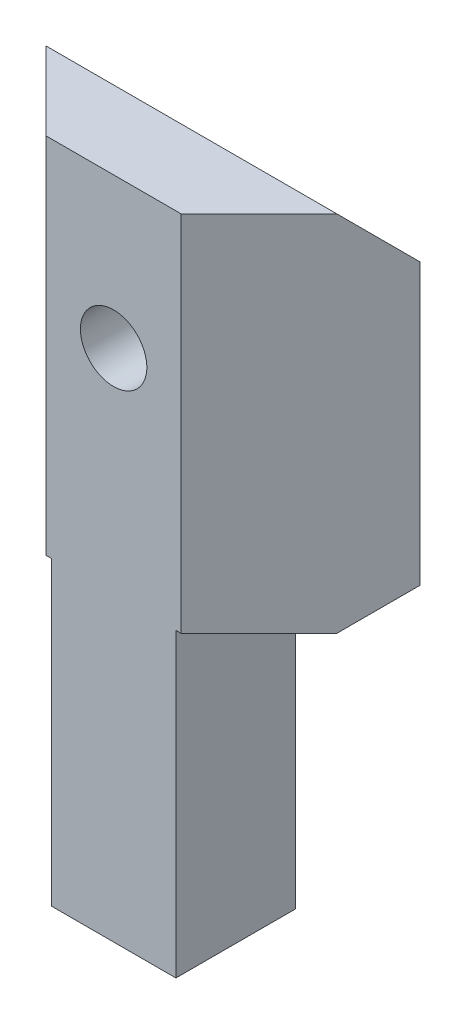
ISO-10303-21;
HEADER;
FILE_DESCRIPTION(('STEP AP214'),'2;1');
FILE_NAME('part.step','',(''),(''),'','','');
FILE_SCHEMA(('AUTOMOTIVE_DESIGN { 1 0 10303 214 1 1 1 1 }'));
ENDSEC;
DATA;
#1=APPLICATION_CONTEXT('core data for automotive mechanical design processes');
#2=APPLICATION_PROTOCOL_DEFINITION('international standard','automotive_design',2000,#1);
#3=PRODUCT_CONTEXT('',#1,'mechanical');
#4=PRODUCT('Part','Part','',(#3));
#5=PRODUCT_RELATED_PRODUCT_CATEGORY('part','',(#4));
#6=PRODUCT_DEFINITION_FORMATION('','',#4);
#7=PRODUCT_DEFINITION_CONTEXT('part definition',#1,'design');
#8=PRODUCT_DEFINITION('design','',#6,#7);
#9=PRODUCT_DEFINITION_SHAPE('','',#8);
#10=(LENGTH_UNIT() NAMED_UNIT(*) SI_UNIT(.MILLI.,.METRE.));
#11=(NAMED_UNIT(*) PLANE_ANGLE_UNIT() SI_UNIT($,.RADIAN.));
#12=(NAMED_UNIT(*) SI_UNIT($,.STERADIAN.) SOLID_ANGLE_UNIT());
#13=UNCERTAINTY_MEASURE_WITH_UNIT(LENGTH_MEASURE(1.E-05),#10,'distance_accuracy_value','');
#14=(GEOMETRIC_REPRESENTATION_CONTEXT(3) GLOBAL_UNCERTAINTY_ASSIGNED_CONTEXT((#13)) GLOBAL_UNIT_ASSIGNED_CONTEXT((#10,
#11,#12)) REPRESENTATION_CONTEXT('',''));
#15=CARTESIAN_POINT('',(0.,0.,0.));
#16=DIRECTION('',(0.,0.,1.));
#17=DIRECTION('',(1.,0.,0.));
#18=AXIS2_PLACEMENT_3D('',#15,#16,#17);
#19=CARTESIAN_POINT('',(-7.80064652290031,24.7693,-0.804871060171912));
#20=DIRECTION('',(0.,0.,-1.));
#21=DIRECTION('',(-1.,0.,0.));
#22=AXIS2_PLACEMENT_3D('',#19,#20,#21);
#23=CYLINDRICAL_SURFACE('',#22,1.6);
#24=CARTESIAN_POINT('',(-7.80064652290031,24.7693,-1.05487106017191));
#25=DIRECTION('',(0.,0.,-1.));
#26=DIRECTION('',(-1.,0.,0.));
#27=AXIS2_PLACEMENT_3D('',#24,#25,#26);
#28=CIRCLE('',#27,1.6);
#29=CARTESIAN_POINT('',(-9.40064652290032,24.7693,-1.05487106017191));
#30=VERTEX_POINT('',#29);
#31=EDGE_CURVE('E123',#30,#30,#28,.F.);
#32=ORIENTED_EDGE('',*,*,#31,.T.);
#33=EDGE_LOOP('',(#32));
#34=FACE_BOUND('',#33,.T.);
#35=CARTESIAN_POINT('',(-7.80064652290031,24.7693,-4.30487106017191));
#36=DIRECTION('',(0.,0.,-1.));
#37=DIRECTION('',(-1.,0.,0.));
#38=AXIS2_PLACEMENT_3D('',#35,#36,#37);
#39=CIRCLE('',#38,1.6);
#40=CARTESIAN_POINT('',(-9.40064652290032,24.7693,-4.30487106017191));
#41=VERTEX_POINT('',#40);
#42=EDGE_CURVE('E181',#41,#41,#39,.F.);
#43=ORIENTED_EDGE('',*,*,#42,.F.);
#44=EDGE_LOOP('',(#43));
#45=FACE_BOUND('',#44,.T.);
#46=ADVANCED_FACE('F31',(#34,#45),#23,.F.);
#47=CARTESIAN_POINT('',(1.19935347709971,32.,-6.80487106017191));
#48=DIRECTION('',(-0.707106781186544,0.,-0.707106781186551));
#49=DIRECTION('',(-0.707106781186551,0.,0.707106781186544));
#50=AXIS2_PLACEMENT_3D('',#47,#48,#49);
#51=PLANE('',#50);
#52=DIRECTION('',(0.707106781186551,0.,-0.707106781186544));
#53=VECTOR('',#52,1.);
#54=CARTESIAN_POINT('',(1.19935347709971,32.,-6.80487106017191));
#55=LINE('',#54,#53);
#56=CARTESIAN_POINT('',(-4.55064652290035,32.,-1.05487106017191));
#57=VERTEX_POINT('',#56);
#58=CARTESIAN_POINT('',(-0.800646522900304,32.,-4.80487106017192));
#59=VERTEX_POINT('',#58);
#60=EDGE_CURVE('E130',#57,#59,#55,.T.);
#61=ORIENTED_EDGE('',*,*,#60,.F.);
#62=DIRECTION('',(0.,-1.,0.));
#63=VECTOR('',#62,1.);
#64=CARTESIAN_POINT('',(-4.55064652290035,32.,-1.05487106017191));
#65=LINE('',#64,#63);
#66=CARTESIAN_POINT('',(-4.55064652290035,14.5,-1.05487106017191));
#67=VERTEX_POINT('',#66);
#68=EDGE_CURVE('E113',#57,#67,#65,.T.);
#69=ORIENTED_EDGE('',*,*,#68,.T.);
#70=DIRECTION('',(-0.707106781186551,0.,0.707106781186544));
#71=VECTOR('',#70,1.);
#72=CARTESIAN_POINT('',(1.19935347709971,14.5,-6.80487106017191));
#73=LINE('',#72,#71);
#74=CARTESIAN_POINT('',(-0.800646522900307,14.5,-4.80487106017192));
#75=VERTEX_POINT('',#74);
#76=EDGE_CURVE('E212',#75,#67,#73,.T.);
#77=ORIENTED_EDGE('',*,*,#76,.F.);
#78=DIRECTION('',(0.577350269189629,0.577350269189625,-0.577350269189623));
#79=VECTOR('',#78,1.);
#80=CARTESIAN_POINT('',(-2.13397985623367,13.1666666666666,-3.47153772683856));
#81=LINE('',#80,#79);
#82=CARTESIAN_POINT('',(1.19935347709971,16.5,-6.80487106017191));
#83=VERTEX_POINT('',#82);
#84=EDGE_CURVE('E176',#75,#83,#81,.T.);
#85=ORIENTED_EDGE('',*,*,#84,.T.);
#86=DIRECTION('',(0.,-1.,0.));
#87=VECTOR('',#86,1.);
#88=CARTESIAN_POINT('',(1.19935347709971,32.,-6.80487106017191));
#89=LINE('',#88,#87);
#90=CARTESIAN_POINT('',(1.19935347709971,30.,-6.80487106017191));
#91=VERTEX_POINT('',#90);
#92=EDGE_CURVE('E145',#91,#83,#89,.T.);
#93=ORIENTED_EDGE('',*,*,#92,.F.);
#94=DIRECTION('',(-0.577350269189629,0.577350269189625,0.577350269189623));
#95=VECTOR('',#94,1.);
#96=CARTESIAN_POINT('',(-3.13397985623369,34.3333333333334,-2.47153772683856));
#97=LINE('',#96,#95);
#98=EDGE_CURVE('E140',#91,#59,#97,.T.);
#99=ORIENTED_EDGE('',*,*,#98,.T.);
#100=EDGE_LOOP('',(#61,#69,#77,#85,#93,#99));
#101=FACE_BOUND('',#100,.T.);
#102=ADVANCED_FACE('F137',(#101),#51,.F.);
#103=CARTESIAN_POINT('',(-10.8006465229004,32.,-0.804871060171912));
#104=DIRECTION('',(0.707106781186549,0.,-0.707106781186547));
#105=DIRECTION('',(-0.707106781186546,0.,-0.707106781186549));
#106=AXIS2_PLACEMENT_3D('',#103,#104,#105);
#107=PLANE('',#106);
#108=DIRECTION('',(-0.707106781186547,0.,-0.707106781186549));
#109=VECTOR('',#108,1.);
#110=CARTESIAN_POINT('',(-16.8006465229003,14.5,-6.80487106017191));
#111=LINE('',#110,#109);
#112=CARTESIAN_POINT('',(-11.0506465229004,14.5,-1.05487106017191));
#113=VERTEX_POINT('',#112);
#114=CARTESIAN_POINT('',(-14.8006465229003,14.5,-4.80487106017191));
#115=VERTEX_POINT('',#114);
#116=EDGE_CURVE('E202',#113,#115,#111,.T.);
#117=ORIENTED_EDGE('',*,*,#116,.F.);
#118=DIRECTION('',(0.,1.,0.));
#119=VECTOR('',#118,1.);
#120=CARTESIAN_POINT('',(-11.0506465229004,32.,-1.05487106017191));
#121=LINE('',#120,#119);
#122=CARTESIAN_POINT('',(-11.0506465229004,32.,-1.05487106017191));
#123=VERTEX_POINT('',#122);
#124=EDGE_CURVE('E46',#113,#123,#121,.T.);
#125=ORIENTED_EDGE('',*,*,#124,.T.);
#126=DIRECTION('',(0.707106781186547,0.,0.707106781186549));
#127=VECTOR('',#126,1.);
#128=CARTESIAN_POINT('',(-10.8006465229004,32.,-0.804871060171912));
#129=LINE('',#128,#127);
#130=CARTESIAN_POINT('',(-14.8006465229003,32.,-4.80487106017191));
#131=VERTEX_POINT('',#130);
#132=EDGE_CURVE('E133',#131,#123,#129,.T.);
#133=ORIENTED_EDGE('',*,*,#132,.F.);
#134=DIRECTION('',(-0.577350269189624,-0.577350269189628,-0.577350269189626));
#135=VECTOR('',#134,1.);
#136=CARTESIAN_POINT('',(-12.467313189567,34.3333333333333,-2.4715377268386));
#137=LINE('',#136,#135);
#138=CARTESIAN_POINT('',(-16.8006465229003,30.,-6.80487106017191));
#139=VERTEX_POINT('',#138);
#140=EDGE_CURVE('E158',#131,#139,#137,.T.);
#141=ORIENTED_EDGE('',*,*,#140,.T.);
#142=DIRECTION('',(0.,-1.,0.));
#143=VECTOR('',#142,1.);
#144=CARTESIAN_POINT('',(-16.8006465229003,32.,-6.80487106017191));
#145=LINE('',#144,#143);
#146=CARTESIAN_POINT('',(-16.8006465229003,16.5,-6.80487106017191));
#147=VERTEX_POINT('',#146);
#148=EDGE_CURVE('E142',#139,#147,#145,.T.);
#149=ORIENTED_EDGE('',*,*,#148,.T.);
#150=DIRECTION('',(-0.577350269189624,0.577350269189628,-0.577350269189626));
#151=VECTOR('',#150,1.);
#152=CARTESIAN_POINT('',(-13.467313189567,13.1666666666667,-3.47153772683859));
#153=LINE('',#152,#151);
#154=EDGE_CURVE('E171',#147,#115,#153,.F.);
#155=ORIENTED_EDGE('',*,*,#154,.T.);
#156=EDGE_LOOP('',(#117,#125,#133,#141,#149,#155));
#157=FACE_BOUND('',#156,.T.);
#158=ADVANCED_FACE('F238',(#157),#107,.F.);
#159=CARTESIAN_POINT('',(-16.8006465229003,32.,-6.80487106017191));
#160=DIRECTION('',(0.,0.,1.));
#161=DIRECTION('',(1.,0.,0.));
#162=AXIS2_PLACEMENT_3D('',#159,#160,#161);
#163=PLANE('',#162);
#164=CARTESIAN_POINT('',(-7.80064652290031,24.7693,-6.80487106017191));
#165=DIRECTION('',(0.,0.,-1.));
#166=DIRECTION('',(-1.,0.,0.));
#167=AXIS2_PLACEMENT_3D('',#164,#165,#166);
#168=CIRCLE('',#167,2.875);
#169=CARTESIAN_POINT('',(-10.6756465229003,24.7693,-6.80487106017191));
#170=VERTEX_POINT('',#169);
#171=EDGE_CURVE('E191',#170,#170,#168,.T.);
#172=ORIENTED_EDGE('',*,*,#171,.F.);
#173=EDGE_LOOP('',(#172));
#174=FACE_BOUND('',#173,.T.);
#175=DIRECTION('',(0.,-1.,0.));
#176=VECTOR('',#175,1.);
#177=CARTESIAN_POINT('',(-10.8006465229004,14.5,-6.80487106017191));
#178=LINE('',#177,#176);
#179=CARTESIAN_POINT('',(-10.8006465229004,16.5,-6.80487106017191));
#180=VERTEX_POINT('',#179);
#181=CARTESIAN_POINT('',(-10.8006465229004,0.,-6.80487106017191));
#182=VERTEX_POINT('',#181);
#183=EDGE_CURVE('E207',#180,#182,#178,.T.);
#184=ORIENTED_EDGE('',*,*,#183,.F.);
#185=DIRECTION('',(-1.,0.,0.));
#186=VECTOR('',#185,1.);
#187=CARTESIAN_POINT('',(-16.8006465229003,16.5,-6.80487106017191));
#188=LINE('',#187,#186);
#189=EDGE_CURVE('E169',#180,#147,#188,.T.);
#190=ORIENTED_EDGE('',*,*,#189,.T.);
#191=ORIENTED_EDGE('',*,*,#148,.F.);
#192=DIRECTION('',(1.,0.,0.));
#193=VECTOR('',#192,1.);
#194=CARTESIAN_POINT('',(1.19935347709971,30.,-6.80487106017191));
#195=LINE('',#194,#193);
#196=EDGE_CURVE('E160',#139,#91,#195,.T.);
#197=ORIENTED_EDGE('',*,*,#196,.T.);
#198=ORIENTED_EDGE('',*,*,#92,.T.);
#199=DIRECTION('',(-1.,0.,0.));
#200=VECTOR('',#199,1.);
#201=CARTESIAN_POINT('',(-4.80064652290035,16.5,-6.80487106017191));
#202=LINE('',#201,#200);
#203=CARTESIAN_POINT('',(-4.80064652290035,16.5,-6.80487106017191));
#204=VERTEX_POINT('',#203);
#205=EDGE_CURVE('E166',#83,#204,#202,.T.);
#206=ORIENTED_EDGE('',*,*,#205,.T.);
#207=DIRECTION('',(0.,-1.,0.));
#208=VECTOR('',#207,1.);
#209=CARTESIAN_POINT('',(-4.80064652290035,14.5,-6.80487106017191));
#210=LINE('',#209,#208);
#211=CARTESIAN_POINT('',(-4.80064652290035,0.,-6.80487106017191));
#212=VERTEX_POINT('',#211);
#213=EDGE_CURVE('E152',#204,#212,#210,.T.);
#214=ORIENTED_EDGE('',*,*,#213,.T.);
#215=DIRECTION('',(-1.,0.,0.));
#216=VECTOR('',#215,1.);
#217=CARTESIAN_POINT('',(-16.8006465229003,0.,-6.80487106017191));
#218=LINE('',#217,#216);
#219=EDGE_CURVE('E147',#212,#182,#218,.T.);
#220=ORIENTED_EDGE('',*,*,#219,.T.);
#221=EDGE_LOOP('',(#184,#190,#191,#197,#198,#206,#214,#220));
#222=FACE_BOUND('',#221,.T.);
#223=ADVANCED_FACE('F218',(#174,#222),#163,.F.);
#224=CARTESIAN_POINT('',(-7.80064652290037,32.,2.19512893982807));
#225=DIRECTION('',(0.,1.,0.));
#226=DIRECTION('',(0.,0.,1.));
#227=AXIS2_PLACEMENT_3D('',#224,#225,#226);
#228=PLANE('',#227);
#229=DIRECTION('',(-1.,0.,0.));
#230=VECTOR('',#229,1.);
#231=CARTESIAN_POINT('',(-12.3310591106609,32.,-1.05487106017191));
#232=LINE('',#231,#230);
#233=EDGE_CURVE('E117',#57,#123,#232,.T.);
#234=ORIENTED_EDGE('',*,*,#233,.F.);
#235=ORIENTED_EDGE('',*,*,#60,.T.);
#236=DIRECTION('',(-1.,0.,0.));
#237=VECTOR('',#236,1.);
#238=CARTESIAN_POINT('',(-16.8006465229003,32.,-4.80487106017191));
#239=LINE('',#238,#237);
#240=EDGE_CURVE('E156',#59,#131,#239,.T.);
#241=ORIENTED_EDGE('',*,*,#240,.T.);
#242=ORIENTED_EDGE('',*,*,#132,.T.);
#243=EDGE_LOOP('',(#234,#235,#241,#242));
#244=FACE_BOUND('',#243,.T.);
#245=ADVANCED_FACE('F128',(#244),#228,.T.);
#246=CARTESIAN_POINT('',(-7.80064652290037,0.,2.19512893982807));
#247=DIRECTION('',(0.,1.,0.));
#248=DIRECTION('',(0.,0.,1.));
#249=AXIS2_PLACEMENT_3D('',#246,#247,#248);
#250=PLANE('',#249);
#251=CARTESIAN_POINT('',(-7.80064652290035,0.,-3.80487106017191));
#252=DIRECTION('',(0.,-1.,0.));
#253=DIRECTION('',(0.,0.,-1.));
#254=AXIS2_PLACEMENT_3D('',#251,#252,#253);
#255=CIRCLE('',#254,1.625);
#256=CARTESIAN_POINT('',(-7.80064652290035,0.,-5.42987106017191));
#257=VERTEX_POINT('',#256);
#258=EDGE_CURVE('E183',#257,#257,#255,.T.);
#259=ORIENTED_EDGE('',*,*,#258,.F.);
#260=EDGE_LOOP('',(#259));
#261=FACE_BOUND('',#260,.T.);
#262=DIRECTION('',(0.,0.,-1.));
#263=VECTOR('',#262,1.);
#264=CARTESIAN_POINT('',(-4.80064652290035,0.,-0.804871060171913));
#265=LINE('',#264,#263);
#266=CARTESIAN_POINT('',(-4.80064652290035,0.,-1.05487106017191));
#267=VERTEX_POINT('',#266);
#268=EDGE_CURVE('E211',#267,#212,#265,.T.);
#269=ORIENTED_EDGE('',*,*,#268,.F.);
#270=DIRECTION('',(1.,0.,0.));
#271=VECTOR('',#270,1.);
#272=CARTESIAN_POINT('',(-2.38005216269954,0.,-1.05487106017191));
#273=LINE('',#272,#271);
#274=CARTESIAN_POINT('',(-10.8006465229004,0.,-1.05487106017191));
#275=VERTEX_POINT('',#274);
#276=EDGE_CURVE('E135',#275,#267,#273,.T.);
#277=ORIENTED_EDGE('',*,*,#276,.F.);
#278=DIRECTION('',(0.,0.,1.));
#279=VECTOR('',#278,1.);
#280=CARTESIAN_POINT('',(-10.8006465229004,0.,-0.804871060171912));
#281=LINE('',#280,#279);
#282=EDGE_CURVE('E200',#182,#275,#281,.T.);
#283=ORIENTED_EDGE('',*,*,#282,.F.);
#284=ORIENTED_EDGE('',*,*,#219,.F.);
#285=EDGE_LOOP('',(#269,#277,#283,#284));
#286=FACE_BOUND('',#285,.T.);
#287=ADVANCED_FACE('F225',(#261,#286),#250,.F.);
#288=CARTESIAN_POINT('',(-7.80064652290037,32.,-4.80487106017191));
#289=DIRECTION('',(0.,0.707106781186546,-0.707106781186549));
#290=DIRECTION('',(0.,0.707106781186549,0.707106781186546));
#291=AXIS2_PLACEMENT_3D('',#288,#289,#290);
#292=PLANE('',#291);
#293=ORIENTED_EDGE('',*,*,#98,.F.);
#294=ORIENTED_EDGE('',*,*,#196,.F.);
#295=ORIENTED_EDGE('',*,*,#140,.F.);
#296=ORIENTED_EDGE('',*,*,#240,.F.);
#297=EDGE_LOOP('',(#293,#294,#295,#296));
#298=FACE_BOUND('',#297,.T.);
#299=ADVANCED_FACE('F286',(#298),#292,.T.);
#300=CARTESIAN_POINT('',(-4.80064652290035,14.5,-0.804871060171913));
#301=DIRECTION('',(-1.,0.,0.));
#302=DIRECTION('',(0.,0.,1.));
#303=AXIS2_PLACEMENT_3D('',#300,#301,#302);
#304=PLANE('',#303);
#305=DIRECTION('',(0.,0.,-1.));
#306=VECTOR('',#305,1.);
#307=CARTESIAN_POINT('',(-4.80064652290035,14.5,-0.804871060171913));
#308=LINE('',#307,#306);
#309=CARTESIAN_POINT('',(-4.80064652290035,14.5,-1.05487106017191));
#310=VERTEX_POINT('',#309);
#311=CARTESIAN_POINT('',(-4.80064652290035,14.5,-4.80487106017191));
#312=VERTEX_POINT('',#311);
#313=EDGE_CURVE('E53',#310,#312,#308,.T.);
#314=ORIENTED_EDGE('',*,*,#313,.F.);
#315=DIRECTION('',(0.,-1.,0.));
#316=VECTOR('',#315,1.);
#317=CARTESIAN_POINT('',(-4.80064652290035,14.5,-1.05487106017191));
#318=LINE('',#317,#316);
#319=EDGE_CURVE('E124',#310,#267,#318,.T.);
#320=ORIENTED_EDGE('',*,*,#319,.T.);
#321=ORIENTED_EDGE('',*,*,#268,.T.);
#322=ORIENTED_EDGE('',*,*,#213,.F.);
#323=DIRECTION('',(0.,-0.707106781186549,0.707106781186546));
#324=VECTOR('',#323,1.);
#325=CARTESIAN_POINT('',(-4.80064652290035,12.5,-2.80487106017192));
#326=LINE('',#325,#324);
#327=EDGE_CURVE('E39',#204,#312,#326,.T.);
#328=ORIENTED_EDGE('',*,*,#327,.T.);
#329=EDGE_LOOP('',(#314,#320,#321,#322,#328));
#330=FACE_BOUND('',#329,.T.);
#331=ADVANCED_FACE('F248',(#330),#304,.F.);
#332=CARTESIAN_POINT('',(-4.80064652290035,14.5,-0.804871060171913));
#333=DIRECTION('',(0.,-1.,0.));
#334=DIRECTION('',(0.,0.,-1.));
#335=AXIS2_PLACEMENT_3D('',#332,#333,#334);
#336=PLANE('',#335);
#337=DIRECTION('',(1.,0.,0.));
#338=VECTOR('',#337,1.);
#339=CARTESIAN_POINT('',(-4.80064652290035,14.5,-1.05487106017191));
#340=LINE('',#339,#338);
#341=EDGE_CURVE('E118',#310,#67,#340,.T.);
#342=ORIENTED_EDGE('',*,*,#341,.F.);
#343=ORIENTED_EDGE('',*,*,#313,.T.);
#344=DIRECTION('',(1.,0.,0.));
#345=VECTOR('',#344,1.);
#346=CARTESIAN_POINT('',(1.19935347709971,14.5,-4.80487106017191));
#347=LINE('',#346,#345);
#348=EDGE_CURVE('E174',#312,#75,#347,.T.);
#349=ORIENTED_EDGE('',*,*,#348,.T.);
#350=ORIENTED_EDGE('',*,*,#76,.T.);
#351=EDGE_LOOP('',(#342,#343,#349,#350));
#352=FACE_BOUND('',#351,.T.);
#353=ADVANCED_FACE('F249',(#352),#336,.T.);
#354=CARTESIAN_POINT('',(-10.8006465229004,14.5,-0.804871060171912));
#355=DIRECTION('',(1.,0.,0.));
#356=DIRECTION('',(0.,0.,-1.));
#357=AXIS2_PLACEMENT_3D('',#354,#355,#356);
#358=PLANE('',#357);
#359=ORIENTED_EDGE('',*,*,#282,.T.);
#360=DIRECTION('',(0.,1.,0.));
#361=VECTOR('',#360,1.);
#362=CARTESIAN_POINT('',(-10.8006465229004,14.5,-1.05487106017191));
#363=LINE('',#362,#361);
#364=CARTESIAN_POINT('',(-10.8006465229004,14.5,-1.05487106017191));
#365=VERTEX_POINT('',#364);
#366=EDGE_CURVE('E134',#275,#365,#363,.T.);
#367=ORIENTED_EDGE('',*,*,#366,.T.);
#368=DIRECTION('',(0.,0.,1.));
#369=VECTOR('',#368,1.);
#370=CARTESIAN_POINT('',(-10.8006465229004,14.5,-0.804871060171912));
#371=LINE('',#370,#369);
#372=CARTESIAN_POINT('',(-10.8006465229004,14.5,-4.80487106017191));
#373=VERTEX_POINT('',#372);
#374=EDGE_CURVE('E204',#373,#365,#371,.T.);
#375=ORIENTED_EDGE('',*,*,#374,.F.);
#376=DIRECTION('',(0.,-0.707106781186549,0.707106781186546));
#377=VECTOR('',#376,1.);
#378=CARTESIAN_POINT('',(-10.8006465229004,12.5,-2.80487106017192));
#379=LINE('',#378,#377);
#380=EDGE_CURVE('E178',#373,#180,#379,.F.);
#381=ORIENTED_EDGE('',*,*,#380,.T.);
#382=ORIENTED_EDGE('',*,*,#183,.T.);
#383=EDGE_LOOP('',(#359,#367,#375,#381,#382));
#384=FACE_BOUND('',#383,.T.);
#385=ADVANCED_FACE('F229',(#384),#358,.F.);
#386=CARTESIAN_POINT('',(-10.8006465229004,14.5,-0.804871060171908));
#387=DIRECTION('',(0.,1.,0.));
#388=DIRECTION('',(0.,0.,1.));
#389=AXIS2_PLACEMENT_3D('',#386,#387,#388);
#390=PLANE('',#389);
#391=ORIENTED_EDGE('',*,*,#374,.T.);
#392=DIRECTION('',(-1.,0.,0.));
#393=VECTOR('',#392,1.);
#394=CARTESIAN_POINT('',(-10.8006465229004,14.5,-1.05487106017191));
#395=LINE('',#394,#393);
#396=EDGE_CURVE('E11',#365,#113,#395,.T.);
#397=ORIENTED_EDGE('',*,*,#396,.T.);
#398=ORIENTED_EDGE('',*,*,#116,.T.);
#399=DIRECTION('',(1.,0.,0.));
#400=VECTOR('',#399,1.);
#401=CARTESIAN_POINT('',(-10.8006465229004,14.5,-4.80487106017191));
#402=LINE('',#401,#400);
#403=EDGE_CURVE('E163',#115,#373,#402,.T.);
#404=ORIENTED_EDGE('',*,*,#403,.T.);
#405=EDGE_LOOP('',(#391,#397,#398,#404));
#406=FACE_BOUND('',#405,.T.);
#407=ADVANCED_FACE('F242',(#406),#390,.F.);
#408=CARTESIAN_POINT('',(-10.8006465229004,14.5,-4.80487106017191));
#409=DIRECTION('',(0.,0.707106781186546,0.707106781186549));
#410=DIRECTION('',(0.,-0.707106781186549,0.707106781186546));
#411=AXIS2_PLACEMENT_3D('',#408,#409,#410);
#412=PLANE('',#411);
#413=ORIENTED_EDGE('',*,*,#154,.F.);
#414=ORIENTED_EDGE('',*,*,#189,.F.);
#415=ORIENTED_EDGE('',*,*,#380,.F.);
#416=ORIENTED_EDGE('',*,*,#403,.F.);
#417=EDGE_LOOP('',(#413,#414,#415,#416));
#418=FACE_BOUND('',#417,.T.);
#419=ADVANCED_FACE('F240',(#418),#412,.F.);
#420=CARTESIAN_POINT('',(-4.80064652290035,14.5,-4.80487106017191));
#421=DIRECTION('',(0.,-0.707106781186546,-0.707106781186549));
#422=DIRECTION('',(0.,0.707106781186549,-0.707106781186546));
#423=AXIS2_PLACEMENT_3D('',#420,#421,#422);
#424=PLANE('',#423);
#425=ORIENTED_EDGE('',*,*,#327,.F.);
#426=ORIENTED_EDGE('',*,*,#205,.F.);
#427=ORIENTED_EDGE('',*,*,#84,.F.);
#428=ORIENTED_EDGE('',*,*,#348,.F.);
#429=EDGE_LOOP('',(#425,#426,#427,#428));
#430=FACE_BOUND('',#429,.T.);
#431=ADVANCED_FACE('F33',(#430),#424,.T.);
#432=CARTESIAN_POINT('',(-7.80064652290035,4.,-3.80487106017191));
#433=DIRECTION('',(0.,-1.,0.));
#434=DIRECTION('',(0.,0.,-1.));
#435=AXIS2_PLACEMENT_3D('',#432,#433,#434);
#436=CYLINDRICAL_SURFACE('',#435,1.625);
#437=CARTESIAN_POINT('',(-7.80064652290035,4.,-3.80487106017191));
#438=DIRECTION('',(0.,-1.,0.));
#439=DIRECTION('',(0.,0.,-1.));
#440=AXIS2_PLACEMENT_3D('',#437,#438,#439);
#441=CIRCLE('',#440,1.625);
#442=CARTESIAN_POINT('',(-7.80064652290035,4.,-5.42987106017191));
#443=VERTEX_POINT('',#442);
#444=EDGE_CURVE('E188',#443,#443,#441,.T.);
#445=ORIENTED_EDGE('',*,*,#444,.F.);
#446=EDGE_LOOP('',(#445));
#447=FACE_BOUND('',#446,.T.);
#448=ORIENTED_EDGE('',*,*,#258,.T.);
#449=EDGE_LOOP('',(#448));
#450=FACE_BOUND('',#449,.T.);
#451=ADVANCED_FACE('F253',(#447,#450),#436,.F.);
#452=CARTESIAN_POINT('',(-7.80064652290035,4.,-3.80487106017191));
#453=DIRECTION('',(0.,-1.,0.));
#454=DIRECTION('',(0.,0.,-1.));
#455=AXIS2_PLACEMENT_3D('',#452,#453,#454);
#456=PLANE('',#455);
#457=ORIENTED_EDGE('',*,*,#444,.T.);
#458=EDGE_LOOP('',(#457));
#459=FACE_BOUND('',#458,.T.);
#460=ADVANCED_FACE('F258',(#459),#456,.T.);
#461=CARTESIAN_POINT('',(-7.80064652290031,24.7693,-4.30487106017191));
#462=DIRECTION('',(0.,0.,-1.));
#463=DIRECTION('',(-1.,0.,0.));
#464=AXIS2_PLACEMENT_3D('',#461,#462,#463);
#465=PLANE('',#464);
#466=CARTESIAN_POINT('',(-7.80064652290031,24.7693,-4.30487106017191));
#467=DIRECTION('',(0.,0.,-1.));
#468=DIRECTION('',(-1.,0.,0.));
#469=AXIS2_PLACEMENT_3D('',#466,#467,#468);
#470=CIRCLE('',#469,2.875);
#471=CARTESIAN_POINT('',(-10.6756465229003,24.7693,-4.30487106017191));
#472=VERTEX_POINT('',#471);
#473=EDGE_CURVE('E184',#472,#472,#470,.T.);
#474=ORIENTED_EDGE('',*,*,#473,.T.);
#475=EDGE_LOOP('',(#474));
#476=FACE_BOUND('',#475,.T.);
#477=ORIENTED_EDGE('',*,*,#42,.T.);
#478=EDGE_LOOP('',(#477));
#479=FACE_BOUND('',#478,.T.);
#480=ADVANCED_FACE('F275',(#476,#479),#465,.T.);
#481=CARTESIAN_POINT('',(-7.80064652290031,24.7693,-4.30487106017191));
#482=DIRECTION('',(0.,0.,-1.));
#483=DIRECTION('',(-1.,0.,0.));
#484=AXIS2_PLACEMENT_3D('',#481,#482,#483);
#485=CYLINDRICAL_SURFACE('',#484,2.875);
#486=ORIENTED_EDGE('',*,*,#473,.F.);
#487=EDGE_LOOP('',(#486));
#488=FACE_BOUND('',#487,.T.);
#489=ORIENTED_EDGE('',*,*,#171,.T.);
#490=EDGE_LOOP('',(#489));
#491=FACE_BOUND('',#490,.T.);
#492=ADVANCED_FACE('F272',(#488,#491),#485,.F.);
#493=CARTESIAN_POINT('',(-12.3310591106609,32.,-1.05487106017191));
#494=DIRECTION('',(0.,0.,-1.));
#495=DIRECTION('',(-1.,0.,0.));
#496=AXIS2_PLACEMENT_3D('',#493,#494,#495);
#497=PLANE('',#496);
#498=ORIENTED_EDGE('',*,*,#233,.T.);
#499=ORIENTED_EDGE('',*,*,#124,.F.);
#500=ORIENTED_EDGE('',*,*,#396,.F.);
#501=ORIENTED_EDGE('',*,*,#366,.F.);
#502=ORIENTED_EDGE('',*,*,#276,.T.);
#503=ORIENTED_EDGE('',*,*,#319,.F.);
#504=ORIENTED_EDGE('',*,*,#341,.T.);
#505=ORIENTED_EDGE('',*,*,#68,.F.);
#506=EDGE_LOOP('',(#498,#499,#500,#501,#502,#503,#504,#505));
#507=FACE_BOUND('',#506,.T.);
#508=ORIENTED_EDGE('',*,*,#31,.F.);
#509=EDGE_LOOP('',(#508));
#510=FACE_BOUND('',#509,.T.);
#511=ADVANCED_FACE('F115',(#507,#510),#497,.F.);
#512=CLOSED_SHELL('',(#46,#102,#158,#223,#245,#287,#299,#331,#353,#385,#407,#419,#431,#451,#460,
#480,#492,#511));
#513=MANIFOLD_SOLID_BREP('B2',#512);
#514=ADVANCED_BREP_SHAPE_REPRESENTATION('',(#18,#513),#14);
#515=SHAPE_DEFINITION_REPRESENTATION(#9,#514);
ENDSEC;
END-ISO-10303-21;
